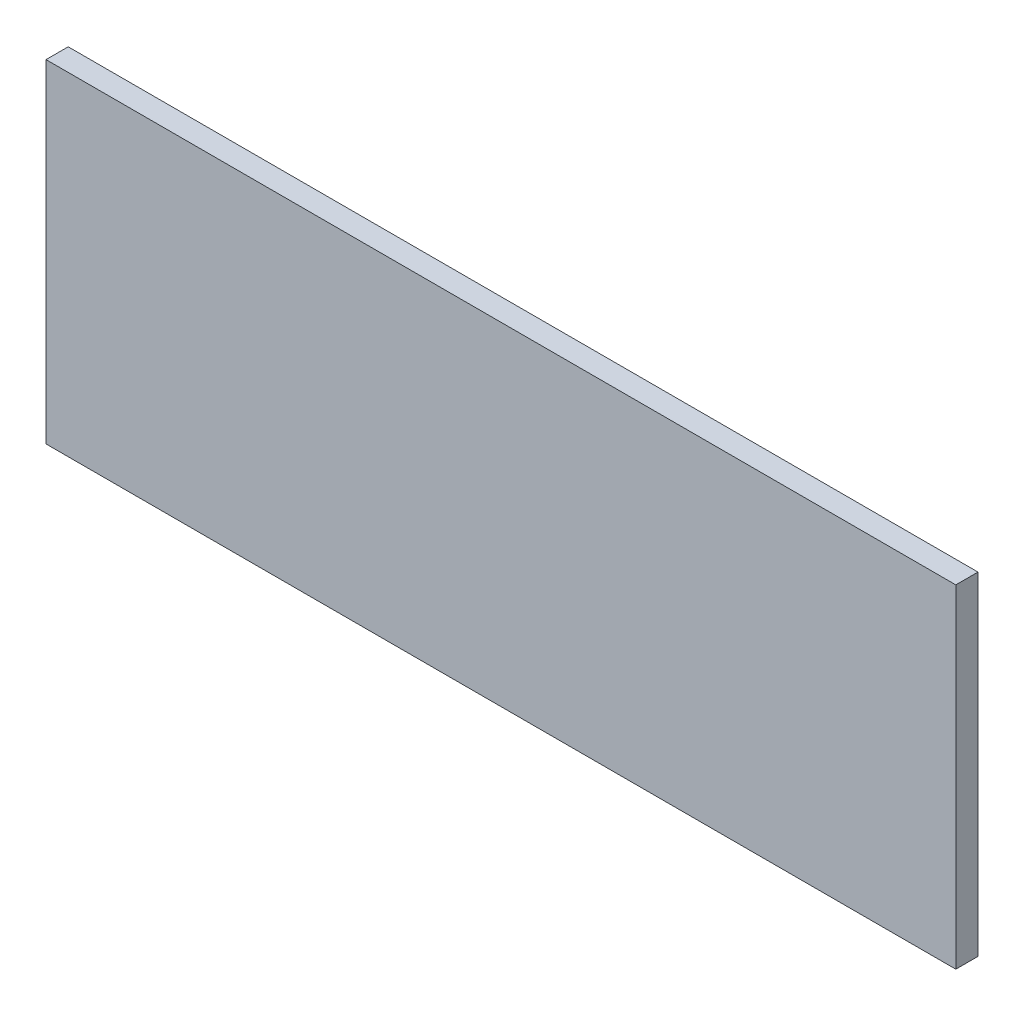
ISO-10303-21;
HEADER;
FILE_DESCRIPTION(('STEP AP214'),'2;1');
FILE_NAME('part.step','',(''),(''),'','','');
FILE_SCHEMA(('AUTOMOTIVE_DESIGN { 1 0 10303 214 1 1 1 1 }'));
ENDSEC;
DATA;
#1=APPLICATION_CONTEXT('core data for automotive mechanical design processes');
#2=APPLICATION_PROTOCOL_DEFINITION('international standard','automotive_design',2000,#1);
#3=PRODUCT_CONTEXT('',#1,'mechanical');
#4=PRODUCT('Part','Part','',(#3));
#5=PRODUCT_RELATED_PRODUCT_CATEGORY('part','',(#4));
#6=PRODUCT_DEFINITION_FORMATION('','',#4);
#7=PRODUCT_DEFINITION_CONTEXT('part definition',#1,'design');
#8=PRODUCT_DEFINITION('design','',#6,#7);
#9=PRODUCT_DEFINITION_SHAPE('','',#8);
#10=(LENGTH_UNIT() NAMED_UNIT(*) SI_UNIT(.MILLI.,.METRE.));
#11=(NAMED_UNIT(*) PLANE_ANGLE_UNIT() SI_UNIT($,.RADIAN.));
#12=(NAMED_UNIT(*) SI_UNIT($,.STERADIAN.) SOLID_ANGLE_UNIT());
#13=UNCERTAINTY_MEASURE_WITH_UNIT(LENGTH_MEASURE(1.E-05),#10,'distance_accuracy_value','');
#14=(GEOMETRIC_REPRESENTATION_CONTEXT(3) GLOBAL_UNCERTAINTY_ASSIGNED_CONTEXT((#13)) GLOBAL_UNIT_ASSIGNED_CONTEXT((#10,
#11,#12)) REPRESENTATION_CONTEXT('',''));
#15=CARTESIAN_POINT('',(0.,0.,0.));
#16=DIRECTION('',(0.,0.,1.));
#17=DIRECTION('',(1.,0.,0.));
#18=AXIS2_PLACEMENT_3D('',#15,#16,#17);
#19=CARTESIAN_POINT('',(82.,30.,-4.));
#20=DIRECTION('',(1.,0.,0.));
#21=DIRECTION('',(0.,0.,-1.));
#22=AXIS2_PLACEMENT_3D('',#19,#20,#21);
#23=PLANE('',#22);
#24=DIRECTION('',(0.,1.,0.));
#25=VECTOR('',#24,1.);
#26=CARTESIAN_POINT('',(82.,30.,0.));
#27=LINE('',#26,#25);
#28=CARTESIAN_POINT('',(82.,-30.,0.));
#29=VERTEX_POINT('',#28);
#30=CARTESIAN_POINT('',(82.,30.,0.));
#31=VERTEX_POINT('',#30);
#32=EDGE_CURVE('E101',#29,#31,#27,.T.);
#33=ORIENTED_EDGE('',*,*,#32,.F.);
#34=DIRECTION('',(0.,0.,1.));
#35=VECTOR('',#34,1.);
#36=CARTESIAN_POINT('',(82.,-30.,-4.));
#37=LINE('',#36,#35);
#38=CARTESIAN_POINT('',(82.,-30.,-4.));
#39=VERTEX_POINT('',#38);
#40=EDGE_CURVE('E11',#39,#29,#37,.T.);
#41=ORIENTED_EDGE('',*,*,#40,.F.);
#42=DIRECTION('',(0.,1.,0.));
#43=VECTOR('',#42,1.);
#44=CARTESIAN_POINT('',(82.,30.,-4.));
#45=LINE('',#44,#43);
#46=CARTESIAN_POINT('',(82.,30.,-4.));
#47=VERTEX_POINT('',#46);
#48=EDGE_CURVE('E95',#39,#47,#45,.T.);
#49=ORIENTED_EDGE('',*,*,#48,.T.);
#50=DIRECTION('',(0.,0.,1.));
#51=VECTOR('',#50,1.);
#52=CARTESIAN_POINT('',(82.,30.,-4.));
#53=LINE('',#52,#51);
#54=EDGE_CURVE('E40',#47,#31,#53,.T.);
#55=ORIENTED_EDGE('',*,*,#54,.T.);
#56=EDGE_LOOP('',(#33,#41,#49,#55));
#57=FACE_BOUND('',#56,.T.);
#58=ADVANCED_FACE('F37',(#57),#23,.T.);
#59=CARTESIAN_POINT('',(-82.,-30.,-4.));
#60=DIRECTION('',(0.,-1.,0.));
#61=DIRECTION('',(0.,0.,-1.));
#62=AXIS2_PLACEMENT_3D('',#59,#60,#61);
#63=PLANE('',#62);
#64=DIRECTION('',(1.,0.,0.));
#65=VECTOR('',#64,1.);
#66=CARTESIAN_POINT('',(-82.,-30.,0.));
#67=LINE('',#66,#65);
#68=CARTESIAN_POINT('',(-82.,-30.,0.));
#69=VERTEX_POINT('',#68);
#70=EDGE_CURVE('E97',#69,#29,#67,.T.);
#71=ORIENTED_EDGE('',*,*,#70,.F.);
#72=DIRECTION('',(0.,0.,1.));
#73=VECTOR('',#72,1.);
#74=CARTESIAN_POINT('',(-82.,-30.,-4.));
#75=LINE('',#74,#73);
#76=CARTESIAN_POINT('',(-82.,-30.,-4.));
#77=VERTEX_POINT('',#76);
#78=EDGE_CURVE('E46',#77,#69,#75,.T.);
#79=ORIENTED_EDGE('',*,*,#78,.F.);
#80=DIRECTION('',(1.,0.,0.));
#81=VECTOR('',#80,1.);
#82=CARTESIAN_POINT('',(-82.,-30.,-4.));
#83=LINE('',#82,#81);
#84=EDGE_CURVE('E92',#77,#39,#83,.T.);
#85=ORIENTED_EDGE('',*,*,#84,.T.);
#86=ORIENTED_EDGE('',*,*,#40,.T.);
#87=EDGE_LOOP('',(#71,#79,#85,#86));
#88=FACE_BOUND('',#87,.T.);
#89=ADVANCED_FACE('F111',(#88),#63,.T.);
#90=CARTESIAN_POINT('',(-82.,30.,-4.));
#91=DIRECTION('',(-1.,0.,0.));
#92=DIRECTION('',(0.,0.,1.));
#93=AXIS2_PLACEMENT_3D('',#90,#91,#92);
#94=PLANE('',#93);
#95=DIRECTION('',(0.,-1.,0.));
#96=VECTOR('',#95,1.);
#97=CARTESIAN_POINT('',(-82.,30.,0.));
#98=LINE('',#97,#96);
#99=CARTESIAN_POINT('',(-82.,30.,0.));
#100=VERTEX_POINT('',#99);
#101=EDGE_CURVE('E87',#100,#69,#98,.T.);
#102=ORIENTED_EDGE('',*,*,#101,.F.);
#103=DIRECTION('',(0.,0.,1.));
#104=VECTOR('',#103,1.);
#105=CARTESIAN_POINT('',(-82.,30.,-4.));
#106=LINE('',#105,#104);
#107=CARTESIAN_POINT('',(-82.,30.,-4.));
#108=VERTEX_POINT('',#107);
#109=EDGE_CURVE('E82',#108,#100,#106,.T.);
#110=ORIENTED_EDGE('',*,*,#109,.F.);
#111=DIRECTION('',(0.,-1.,0.));
#112=VECTOR('',#111,1.);
#113=CARTESIAN_POINT('',(-82.,30.,-4.));
#114=LINE('',#113,#112);
#115=EDGE_CURVE('E85',#108,#77,#114,.T.);
#116=ORIENTED_EDGE('',*,*,#115,.T.);
#117=ORIENTED_EDGE('',*,*,#78,.T.);
#118=EDGE_LOOP('',(#102,#110,#116,#117));
#119=FACE_BOUND('',#118,.T.);
#120=ADVANCED_FACE('F84',(#119),#94,.T.);
#121=CARTESIAN_POINT('',(-82.,30.,-4.));
#122=DIRECTION('',(0.,1.,0.));
#123=DIRECTION('',(0.,0.,1.));
#124=AXIS2_PLACEMENT_3D('',#121,#122,#123);
#125=PLANE('',#124);
#126=DIRECTION('',(-1.,0.,0.));
#127=VECTOR('',#126,1.);
#128=CARTESIAN_POINT('',(-82.,30.,0.));
#129=LINE('',#128,#127);
#130=EDGE_CURVE('E104',#31,#100,#129,.T.);
#131=ORIENTED_EDGE('',*,*,#130,.F.);
#132=ORIENTED_EDGE('',*,*,#54,.F.);
#133=DIRECTION('',(-1.,0.,0.));
#134=VECTOR('',#133,1.);
#135=CARTESIAN_POINT('',(-82.,30.,-4.));
#136=LINE('',#135,#134);
#137=EDGE_CURVE('E91',#47,#108,#136,.T.);
#138=ORIENTED_EDGE('',*,*,#137,.T.);
#139=ORIENTED_EDGE('',*,*,#109,.T.);
#140=EDGE_LOOP('',(#131,#132,#138,#139));
#141=FACE_BOUND('',#140,.T.);
#142=ADVANCED_FACE('F94',(#141),#125,.T.);
#143=CARTESIAN_POINT('',(0.,0.,-4.));
#144=DIRECTION('',(0.,0.,1.));
#145=DIRECTION('',(1.,0.,0.));
#146=AXIS2_PLACEMENT_3D('',#143,#144,#145);
#147=PLANE('',#146);
#148=ORIENTED_EDGE('',*,*,#48,.F.);
#149=ORIENTED_EDGE('',*,*,#84,.F.);
#150=ORIENTED_EDGE('',*,*,#115,.F.);
#151=ORIENTED_EDGE('',*,*,#137,.F.);
#152=EDGE_LOOP('',(#148,#149,#150,#151));
#153=FACE_BOUND('',#152,.T.);
#154=ADVANCED_FACE('F90',(#153),#147,.F.);
#155=CARTESIAN_POINT('',(0.,0.,0.));
#156=DIRECTION('',(0.,0.,1.));
#157=DIRECTION('',(1.,0.,0.));
#158=AXIS2_PLACEMENT_3D('',#155,#156,#157);
#159=PLANE('',#158);
#160=ORIENTED_EDGE('',*,*,#32,.T.);
#161=ORIENTED_EDGE('',*,*,#130,.T.);
#162=ORIENTED_EDGE('',*,*,#101,.T.);
#163=ORIENTED_EDGE('',*,*,#70,.T.);
#164=EDGE_LOOP('',(#160,#161,#162,#163));
#165=FACE_BOUND('',#164,.T.);
#166=ADVANCED_FACE('F110',(#165),#159,.T.);
#167=CLOSED_SHELL('',(#58,#89,#120,#142,#154,#166));
#168=MANIFOLD_SOLID_BREP('B2',#167);
#169=ADVANCED_BREP_SHAPE_REPRESENTATION('',(#18,#168),#14);
#170=SHAPE_DEFINITION_REPRESENTATION(#9,#169);
ENDSEC;
END-ISO-10303-21;
